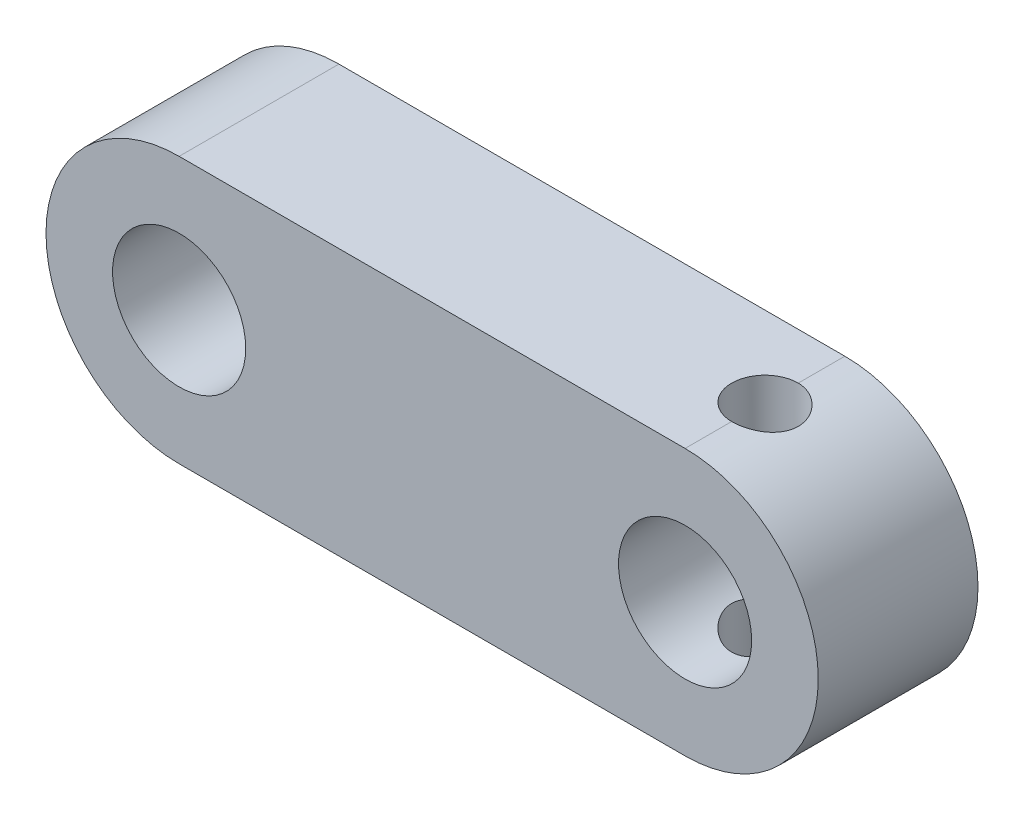
ISO-10303-21;
HEADER;
FILE_DESCRIPTION(('STEP AP214'),'2;1');
FILE_NAME('part.step','',(''),(''),'','','');
FILE_SCHEMA(('AUTOMOTIVE_DESIGN { 1 0 10303 214 1 1 1 1 }'));
ENDSEC;
DATA;
#1=APPLICATION_CONTEXT('core data for automotive mechanical design processes');
#2=APPLICATION_PROTOCOL_DEFINITION('international standard','automotive_design',2000,#1);
#3=PRODUCT_CONTEXT('',#1,'mechanical');
#4=PRODUCT('Part','Part','',(#3));
#5=PRODUCT_RELATED_PRODUCT_CATEGORY('part','',(#4));
#6=PRODUCT_DEFINITION_FORMATION('','',#4);
#7=PRODUCT_DEFINITION_CONTEXT('part definition',#1,'design');
#8=PRODUCT_DEFINITION('design','',#6,#7);
#9=PRODUCT_DEFINITION_SHAPE('','',#8);
#10=(LENGTH_UNIT() NAMED_UNIT(*) SI_UNIT(.MILLI.,.METRE.));
#11=(NAMED_UNIT(*) PLANE_ANGLE_UNIT() SI_UNIT($,.RADIAN.));
#12=(NAMED_UNIT(*) SI_UNIT($,.STERADIAN.) SOLID_ANGLE_UNIT());
#13=UNCERTAINTY_MEASURE_WITH_UNIT(LENGTH_MEASURE(1.E-05),#10,'distance_accuracy_value','');
#14=(GEOMETRIC_REPRESENTATION_CONTEXT(3) GLOBAL_UNCERTAINTY_ASSIGNED_CONTEXT((#13)) GLOBAL_UNIT_ASSIGNED_CONTEXT((#10,
#11,#12)) REPRESENTATION_CONTEXT('',''));
#15=CARTESIAN_POINT('',(0.,0.,0.));
#16=DIRECTION('',(0.,0.,1.));
#17=DIRECTION('',(1.,0.,0.));
#18=AXIS2_PLACEMENT_3D('',#15,#16,#17);
#19=CARTESIAN_POINT('',(0.,-5.,6.));
#20=DIRECTION('',(0.,1.,0.));
#21=DIRECTION('',(-1.,0.,0.));
#22=AXIS2_PLACEMENT_3D('',#19,#20,#21);
#23=PLANE('',#22);
#24=DIRECTION('',(0.,0.,-1.));
#25=VECTOR('',#24,1.);
#26=CARTESIAN_POINT('',(0.,-5.,6.));
#27=LINE('',#26,#25);
#28=CARTESIAN_POINT('',(0.,-5.,1.75));
#29=VERTEX_POINT('',#28);
#30=CARTESIAN_POINT('',(0.,-5.,0.));
#31=VERTEX_POINT('',#30);
#32=EDGE_CURVE('E59',#29,#31,#27,.T.);
#33=ORIENTED_EDGE('',*,*,#32,.F.);
#34=CARTESIAN_POINT('',(0.,-5.,3.));
#35=DIRECTION('',(0.,1.,0.));
#36=DIRECTION('',(-1.,0.,0.));
#37=AXIS2_PLACEMENT_3D('',#34,#35,#36);
#38=CIRCLE('',#37,1.25);
#39=CARTESIAN_POINT('',(0.,-5.,4.25));
#40=VERTEX_POINT('',#39);
#41=EDGE_CURVE('E66',#29,#40,#38,.T.);
#42=ORIENTED_EDGE('',*,*,#41,.T.);
#43=CARTESIAN_POINT('',(0.,-5.,6.));
#44=VERTEX_POINT('',#43);
#45=EDGE_CURVE('E11',#44,#40,#27,.T.);
#46=ORIENTED_EDGE('',*,*,#45,.F.);
#47=DIRECTION('',(1.,0.,0.));
#48=VECTOR('',#47,1.);
#49=CARTESIAN_POINT('',(0.,-5.,6.));
#50=LINE('',#49,#48);
#51=CARTESIAN_POINT('',(-19.,-5.,6.));
#52=VERTEX_POINT('',#51);
#53=EDGE_CURVE('E128',#52,#44,#50,.T.);
#54=ORIENTED_EDGE('',*,*,#53,.F.);
#55=DIRECTION('',(0.,0.,-1.));
#56=VECTOR('',#55,1.);
#57=CARTESIAN_POINT('',(-19.,-5.,6.));
#58=LINE('',#57,#56);
#59=CARTESIAN_POINT('',(-19.,-5.,0.));
#60=VERTEX_POINT('',#59);
#61=EDGE_CURVE('E161',#52,#60,#58,.T.);
#62=ORIENTED_EDGE('',*,*,#61,.T.);
#63=DIRECTION('',(1.,0.,0.));
#64=VECTOR('',#63,1.);
#65=CARTESIAN_POINT('',(0.,-5.,0.));
#66=LINE('',#65,#64);
#67=EDGE_CURVE('E107',#60,#31,#66,.T.);
#68=ORIENTED_EDGE('',*,*,#67,.T.);
#69=EDGE_LOOP('',(#33,#42,#46,#54,#62,#68));
#70=FACE_BOUND('',#69,.T.);
#71=ADVANCED_FACE('F45',(#70),#23,.F.);
#72=CARTESIAN_POINT('',(0.,0.,6.));
#73=DIRECTION('',(0.,0.,-1.));
#74=DIRECTION('',(-1.,0.,0.));
#75=AXIS2_PLACEMENT_3D('',#72,#73,#74);
#76=CYLINDRICAL_SURFACE('',#75,5.);
#77=ORIENTED_EDGE('',*,*,#45,.T.);
#78=CARTESIAN_POINT('',(0.,-5.,4.25));
#79=CARTESIAN_POINT('',(0.0345958562302209,-5.0000019722579,4.25000037596728));
#80=CARTESIAN_POINT('',(0.0691746356614408,-4.99964049853327,4.24856283362232));
#81=CARTESIAN_POINT('',(0.138074690009065,-4.99821165670057,4.24283189960491));
#82=CARTESIAN_POINT('',(0.172396004134671,-4.99714439837747,4.23853895209085));
#83=CARTESIAN_POINT('',(0.274465139321112,-4.99292311200059,4.22143810912928));
#84=CARTESIAN_POINT('',(0.341513249243137,-4.98874933969322,4.20440795127064));
#85=CARTESIAN_POINT('',(0.471688999751382,-4.97813091950626,4.15963564004484));
#86=CARTESIAN_POINT('',(0.534816787719993,-4.97168635705668,4.13189388965757));
#87=CARTESIAN_POINT('',(0.655545572093235,-4.95721274975939,4.06652314364557));
#88=CARTESIAN_POINT('',(0.71314528123347,-4.9491833371887,4.02889185273901));
#89=CARTESIAN_POINT('',(0.822333748844299,-4.93222877596496,3.94400088744877));
#90=CARTESIAN_POINT('',(0.873792811810744,-4.92328989428,3.89657720409775));
#91=CARTESIAN_POINT('',(0.968120686343936,-4.90561414775425,3.79379395796541));
#92=CARTESIAN_POINT('',(1.01098788995103,-4.89687732099803,3.73843291303243));
#93=CARTESIAN_POINT('',(1.08752317675397,-4.88045625179407,3.62033577282372));
#94=CARTESIAN_POINT('',(1.12104525768935,-4.87278955964096,3.55750239807233));
#95=CARTESIAN_POINT('',(1.17699856517473,-4.85957883642674,3.42687282973704));
#96=CARTESIAN_POINT('',(1.19943213398498,-4.85403435714,3.35907768771897));
#97=CARTESIAN_POINT('',(1.23212885111741,-4.84583735219479,3.22188118870495));
#98=CARTESIAN_POINT('',(1.24262665465126,-4.84312915309136,3.15253915845085));
#99=CARTESIAN_POINT('',(1.25188483835239,-4.84074468104983,3.0130277818398));
#100=CARTESIAN_POINT('',(1.25064686323158,-4.84106798326159,2.94285855278733));
#101=CARTESIAN_POINT('',(1.23665540776577,-4.8446600537067,2.80548652119275));
#102=CARTESIAN_POINT('',(1.22418184235989,-4.84785722065672,2.73825304428463));
#103=CARTESIAN_POINT('',(1.18851994298185,-4.85672263131267,2.6068652143792));
#104=CARTESIAN_POINT('',(1.16533094165133,-4.86239102892584,2.54271105343673));
#105=CARTESIAN_POINT('',(1.10865758109375,-4.87562602763813,2.41855092105437));
#106=CARTESIAN_POINT('',(1.07507149815993,-4.88321124161778,2.35859344948369));
#107=CARTESIAN_POINT('',(0.998629152870575,-4.89941445969409,2.24506647360989));
#108=CARTESIAN_POINT('',(0.955771485879237,-4.9080326201928,2.19149793913414));
#109=CARTESIAN_POINT('',(0.860558578337779,-4.9256313291404,2.09066946045423));
#110=CARTESIAN_POINT('',(0.807968103158214,-4.934615217068,2.04363198022335));
#111=CARTESIAN_POINT('',(0.695522582665563,-4.95171452428336,1.95899080021958));
#112=CARTESIAN_POINT('',(0.635665674524647,-4.95982971986492,1.92138952712924));
#113=CARTESIAN_POINT('',(0.510059841233778,-4.97431911628217,1.85660391585496));
#114=CARTESIAN_POINT('',(0.444288505949123,-4.98068629005484,1.82946145081492));
#115=CARTESIAN_POINT('',(0.308960596166964,-4.9909041477363,1.78671476563129));
#116=CARTESIAN_POINT('',(0.239409727026567,-4.99475851645472,1.77109364600094));
#117=CARTESIAN_POINT('',(0.141048479948131,-4.99808972265327,1.75765946217707));
#118=CARTESIAN_POINT('',(0.112896362009207,-4.99880512587133,1.75478660897153));
#119=CARTESIAN_POINT('',(0.0565006133131124,-4.9997600048023,1.7509590589455));
#120=CARTESIAN_POINT('',(0.028257209871407,-5.00000026301356,1.75000120835114));
#121=CARTESIAN_POINT('',(0.,-5.,1.74999999999999));
#122=B_SPLINE_CURVE_WITH_KNOTS('',3,(#78,#79,#80,#81,#82,#83,#84,#85,#86,#87,#88,#89,#90,#91,
#92,#93,#94,#95,#96,#97,#98,#99,#100,#101,#102,#103,#104,#105,#106,#107,#108,#109,#110,#111,
#112,#113,#114,#115,#116,#117,#118,#119,#120,#121),.UNSPECIFIED.,.F.,.F.,(4,2,2,2,2,2,2,2,2,2,2,
2,2,2,2,2,2,2,2,2,2,4),(0.,0.103722196092524,0.20742826196518,0.414262729871484,
0.621089417234318,0.827964149845958,1.03863501957543,1.24934527945168,1.46318342246191,
1.67697637646465,1.88648929459231,2.09597285094458,2.30037759052328,2.50479506216467,
2.7112793574333,2.91779495680266,3.1301776699636,3.34261494514174,3.55589411497133,
3.76885982177052,3.85372663354223,3.93845356459796),.UNSPECIFIED.);
#123=EDGE_CURVE('E102',#40,#29,#122,.T.);
#124=ORIENTED_EDGE('',*,*,#123,.T.);
#125=ORIENTED_EDGE('',*,*,#32,.T.);
#126=CARTESIAN_POINT('',(0.,0.,0.));
#127=DIRECTION('',(0.,0.,1.));
#128=DIRECTION('',(1.,0.,0.));
#129=AXIS2_PLACEMENT_3D('',#126,#127,#128);
#130=CIRCLE('',#129,5.);
#131=CARTESIAN_POINT('',(0.,5.,0.));
#132=VERTEX_POINT('',#131);
#133=EDGE_CURVE('E164',#31,#132,#130,.T.);
#134=ORIENTED_EDGE('',*,*,#133,.T.);
#135=DIRECTION('',(0.,0.,-1.));
#136=VECTOR('',#135,1.);
#137=CARTESIAN_POINT('',(0.,5.,6.));
#138=LINE('',#137,#136);
#139=CARTESIAN_POINT('',(0.,5.,1.75));
#140=VERTEX_POINT('',#139);
#141=EDGE_CURVE('E183',#140,#132,#138,.T.);
#142=ORIENTED_EDGE('',*,*,#141,.F.);
#143=CARTESIAN_POINT('',(0.,5.,1.75));
#144=CARTESIAN_POINT('',(0.0345958562302198,5.0000019722579,1.74999962403272));
#145=CARTESIAN_POINT('',(0.0691746356614397,4.99964049853327,1.75143716637768));
#146=CARTESIAN_POINT('',(0.138074690009063,4.99821165670057,1.75716810039509));
#147=CARTESIAN_POINT('',(0.17239600413467,4.99714439837747,1.76146104790916));
#148=CARTESIAN_POINT('',(0.274465139321111,4.99292311200059,1.77856189087072));
#149=CARTESIAN_POINT('',(0.341513249243136,4.98874933969321,1.79559204872936));
#150=CARTESIAN_POINT('',(0.471688999751381,4.97813091950626,1.84036435995516));
#151=CARTESIAN_POINT('',(0.534816787719992,4.97168635705668,1.86810611034243));
#152=CARTESIAN_POINT('',(0.655545572093234,4.95721274975939,1.93347685635443));
#153=CARTESIAN_POINT('',(0.713145281233469,4.9491833371887,1.97110814726099));
#154=CARTESIAN_POINT('',(0.822333748844298,4.93222877596496,2.05599911255123));
#155=CARTESIAN_POINT('',(0.873792811810742,4.92328989428,2.10342279590225));
#156=CARTESIAN_POINT('',(0.968120686343934,4.90561414775425,2.20620604203459));
#157=CARTESIAN_POINT('',(1.01098788995103,4.89687732099803,2.26156708696757));
#158=CARTESIAN_POINT('',(1.08752317675397,4.88045625179407,2.37966422717628));
#159=CARTESIAN_POINT('',(1.12104525768934,4.87278955964096,2.44249760192767));
#160=CARTESIAN_POINT('',(1.17699856517472,4.85957883642674,2.57312717026296));
#161=CARTESIAN_POINT('',(1.19943213398498,4.85403435714,2.64092231228103));
#162=CARTESIAN_POINT('',(1.23212885111741,4.84583735219479,2.77811881129505));
#163=CARTESIAN_POINT('',(1.24262665465126,4.84312915309136,2.84746084154916));
#164=CARTESIAN_POINT('',(1.25188483835239,4.84074468104983,2.9869722181602));
#165=CARTESIAN_POINT('',(1.25064686323158,4.84106798326159,3.05714144721267));
#166=CARTESIAN_POINT('',(1.23665540776577,4.8446600537067,3.19451347880725));
#167=CARTESIAN_POINT('',(1.22418184235989,4.84785722065672,3.26174695571537));
#168=CARTESIAN_POINT('',(1.18851994298185,4.85672263131267,3.3931347856208));
#169=CARTESIAN_POINT('',(1.16533094165133,4.86239102892585,3.45728894656327));
#170=CARTESIAN_POINT('',(1.10865758109375,4.87562602763813,3.58144907894563));
#171=CARTESIAN_POINT('',(1.07507149815992,4.88321124161778,3.64140655051632));
#172=CARTESIAN_POINT('',(0.998629152870572,4.89941445969409,3.75493352639011));
#173=CARTESIAN_POINT('',(0.955771485879234,4.9080326201928,3.80850206086586));
#174=CARTESIAN_POINT('',(0.860558578337777,4.9256313291404,3.90933053954577));
#175=CARTESIAN_POINT('',(0.807968103158212,4.934615217068,3.95636801977665));
#176=CARTESIAN_POINT('',(0.695522582665561,4.95171452428336,4.04100919978042));
#177=CARTESIAN_POINT('',(0.635665674524645,4.95982971986492,4.07861047287076));
#178=CARTESIAN_POINT('',(0.510059841233776,4.97431911628217,4.14339608414504));
#179=CARTESIAN_POINT('',(0.444288505949121,4.98068629005484,4.17053854918508));
#180=CARTESIAN_POINT('',(0.308960596166962,4.9909041477363,4.21328523436871));
#181=CARTESIAN_POINT('',(0.239409727026564,4.99475851645472,4.22890635399906));
#182=CARTESIAN_POINT('',(0.141048479948129,4.99808972265327,4.24234053782293));
#183=CARTESIAN_POINT('',(0.112896362009205,4.99880512587133,4.24521339102847));
#184=CARTESIAN_POINT('',(0.0565006133131106,4.9997600048023,4.2490409410545));
#185=CARTESIAN_POINT('',(0.0282572098714055,5.00000026301356,4.24999879164886));
#186=CARTESIAN_POINT('',(0.,5.,4.25000000000001));
#187=B_SPLINE_CURVE_WITH_KNOTS('',3,(#143,#144,#145,#146,#147,#148,#149,#150,#151,#152,#153,
#154,#155,#156,#157,#158,#159,#160,#161,#162,#163,#164,#165,#166,#167,#168,#169,#170,#171,#172,
#173,#174,#175,#176,#177,#178,#179,#180,#181,#182,#183,#184,#185,#186),.UNSPECIFIED.,.F.,.F.,(4,
2,2,2,2,2,2,2,2,2,2,2,2,2,2,2,2,2,2,2,2,4),(0.,0.103722196092524,0.20742826196518,
0.414262729871484,0.621089417234318,0.827964149845958,1.03863501957543,1.24934527945168,
1.46318342246191,1.67697637646465,1.88648929459231,2.09597285094458,2.30037759052328,
2.50479506216467,2.7112793574333,2.91779495680266,3.1301776699636,3.34261494514174,
3.55589411497132,3.76885982177052,3.85372663354223,3.93845356459796),.UNSPECIFIED.);
#188=CARTESIAN_POINT('',(0.,5.,4.25));
#189=VERTEX_POINT('',#188);
#190=EDGE_CURVE('E73',#140,#189,#187,.T.);
#191=ORIENTED_EDGE('',*,*,#190,.T.);
#192=CARTESIAN_POINT('',(0.,5.,6.));
#193=VERTEX_POINT('',#192);
#194=EDGE_CURVE('E122',#193,#189,#138,.T.);
#195=ORIENTED_EDGE('',*,*,#194,.F.);
#196=CARTESIAN_POINT('',(0.,0.,6.));
#197=DIRECTION('',(0.,0.,1.));
#198=DIRECTION('',(1.,0.,0.));
#199=AXIS2_PLACEMENT_3D('',#196,#197,#198);
#200=CIRCLE('',#199,5.);
#201=EDGE_CURVE('E119',#44,#193,#200,.T.);
#202=ORIENTED_EDGE('',*,*,#201,.F.);
#203=EDGE_LOOP('',(#77,#124,#125,#134,#142,#191,#195,#202));
#204=FACE_BOUND('',#203,.T.);
#205=ADVANCED_FACE('F117',(#204),#76,.T.);
#206=CARTESIAN_POINT('',(0.,5.,6.));
#207=DIRECTION('',(0.,1.,0.));
#208=DIRECTION('',(-1.,0.,0.));
#209=AXIS2_PLACEMENT_3D('',#206,#207,#208);
#210=PLANE('',#209);
#211=CARTESIAN_POINT('',(0.,5.,3.));
#212=DIRECTION('',(0.,1.,0.));
#213=DIRECTION('',(-1.,0.,0.));
#214=AXIS2_PLACEMENT_3D('',#211,#212,#213);
#215=CIRCLE('',#214,1.25);
#216=EDGE_CURVE('E115',#140,#189,#215,.T.);
#217=ORIENTED_EDGE('',*,*,#216,.F.);
#218=ORIENTED_EDGE('',*,*,#141,.T.);
#219=DIRECTION('',(1.,0.,0.));
#220=VECTOR('',#219,1.);
#221=CARTESIAN_POINT('',(0.,5.,0.));
#222=LINE('',#221,#220);
#223=CARTESIAN_POINT('',(-19.,5.,0.));
#224=VERTEX_POINT('',#223);
#225=EDGE_CURVE('E168',#224,#132,#222,.T.);
#226=ORIENTED_EDGE('',*,*,#225,.F.);
#227=DIRECTION('',(0.,0.,-1.));
#228=VECTOR('',#227,1.);
#229=CARTESIAN_POINT('',(-19.,5.,6.));
#230=LINE('',#229,#228);
#231=CARTESIAN_POINT('',(-19.,5.,6.));
#232=VERTEX_POINT('',#231);
#233=EDGE_CURVE('E180',#232,#224,#230,.T.);
#234=ORIENTED_EDGE('',*,*,#233,.F.);
#235=DIRECTION('',(1.,0.,0.));
#236=VECTOR('',#235,1.);
#237=CARTESIAN_POINT('',(0.,5.,6.));
#238=LINE('',#237,#236);
#239=EDGE_CURVE('E127',#232,#193,#238,.T.);
#240=ORIENTED_EDGE('',*,*,#239,.T.);
#241=ORIENTED_EDGE('',*,*,#194,.T.);
#242=EDGE_LOOP('',(#217,#218,#226,#234,#240,#241));
#243=FACE_BOUND('',#242,.T.);
#244=ADVANCED_FACE('F211',(#243),#210,.T.);
#245=CARTESIAN_POINT('',(-19.,0.,6.));
#246=DIRECTION('',(0.,0.,-1.));
#247=DIRECTION('',(-1.,0.,0.));
#248=AXIS2_PLACEMENT_3D('',#245,#246,#247);
#249=CYLINDRICAL_SURFACE('',#248,2.5);
#250=CARTESIAN_POINT('',(-19.,0.,6.));
#251=DIRECTION('',(0.,0.,1.));
#252=DIRECTION('',(1.,0.,0.));
#253=AXIS2_PLACEMENT_3D('',#250,#251,#252);
#254=CIRCLE('',#253,2.5);
#255=CARTESIAN_POINT('',(-16.5,0.,6.));
#256=VERTEX_POINT('',#255);
#257=EDGE_CURVE('E153',#256,#256,#254,.T.);
#258=ORIENTED_EDGE('',*,*,#257,.T.);
#259=EDGE_LOOP('',(#258));
#260=FACE_BOUND('',#259,.T.);
#261=CARTESIAN_POINT('',(-19.,0.,0.));
#262=DIRECTION('',(0.,0.,1.));
#263=DIRECTION('',(1.,0.,0.));
#264=AXIS2_PLACEMENT_3D('',#261,#262,#263);
#265=CIRCLE('',#264,2.5);
#266=CARTESIAN_POINT('',(-16.5,0.,0.));
#267=VERTEX_POINT('',#266);
#268=EDGE_CURVE('E141',#267,#267,#265,.T.);
#269=ORIENTED_EDGE('',*,*,#268,.F.);
#270=EDGE_LOOP('',(#269));
#271=FACE_BOUND('',#270,.T.);
#272=ADVANCED_FACE('F215',(#260,#271),#249,.F.);
#273=CARTESIAN_POINT('',(-19.,0.,6.));
#274=DIRECTION('',(0.,0.,-1.));
#275=DIRECTION('',(-1.,0.,0.));
#276=AXIS2_PLACEMENT_3D('',#273,#274,#275);
#277=CYLINDRICAL_SURFACE('',#276,5.);
#278=CARTESIAN_POINT('',(-19.,0.,0.));
#279=DIRECTION('',(0.,0.,1.));
#280=DIRECTION('',(1.,0.,0.));
#281=AXIS2_PLACEMENT_3D('',#278,#279,#280);
#282=CIRCLE('',#281,5.);
#283=EDGE_CURVE('E172',#224,#60,#282,.T.);
#284=ORIENTED_EDGE('',*,*,#283,.T.);
#285=ORIENTED_EDGE('',*,*,#61,.F.);
#286=CARTESIAN_POINT('',(-19.,0.,6.));
#287=DIRECTION('',(0.,0.,1.));
#288=DIRECTION('',(1.,0.,0.));
#289=AXIS2_PLACEMENT_3D('',#286,#287,#288);
#290=CIRCLE('',#289,5.);
#291=EDGE_CURVE('E133',#232,#52,#290,.T.);
#292=ORIENTED_EDGE('',*,*,#291,.F.);
#293=ORIENTED_EDGE('',*,*,#233,.T.);
#294=EDGE_LOOP('',(#284,#285,#292,#293));
#295=FACE_BOUND('',#294,.T.);
#296=ADVANCED_FACE('F217',(#295),#277,.T.);
#297=CARTESIAN_POINT('',(0.,0.,6.));
#298=DIRECTION('',(0.,0.,-1.));
#299=DIRECTION('',(-1.,0.,0.));
#300=AXIS2_PLACEMENT_3D('',#297,#298,#299);
#301=CYLINDRICAL_SURFACE('',#300,2.5);
#302=CARTESIAN_POINT('',(-1.25,-2.1650635094611,3.));
#303=CARTESIAN_POINT('',(-1.24999545384316,-2.16506918410574,3.06513476024406));
#304=CARTESIAN_POINT('',(-1.24487496341652,-2.16804751484696,3.13035176440631));
#305=CARTESIAN_POINT('',(-1.22465401237257,-2.17952958065066,3.25878408084644));
#306=CARTESIAN_POINT('',(-1.20953258069272,-2.18804492569449,3.32199489380426));
#307=CARTESIAN_POINT('',(-1.17012493587476,-2.20936683256748,3.44431458042993));
#308=CARTESIAN_POINT('',(-1.14588744061716,-2.22215054341565,3.50344331559198));
#309=CARTESIAN_POINT('',(-1.08908440672046,-2.25053331021072,3.6167802524959));
#310=CARTESIAN_POINT('',(-1.05651841754472,-2.26613251845081,3.67098818782807));
#311=CARTESIAN_POINT('',(-0.980833175663597,-2.29996086321802,3.77788216069688));
#312=CARTESIAN_POINT('',(-0.937065045179712,-2.31830079547442,3.83007391959193));
#313=CARTESIAN_POINT('',(-0.841567259518084,-2.35464978482132,3.92676048550839));
#314=CARTESIAN_POINT('',(-0.789833657227865,-2.37265867289062,3.9712514532294));
#315=CARTESIAN_POINT('',(-0.675611954268181,-2.40776846191186,4.05420893893458));
#316=CARTESIAN_POINT('',(-0.612633986265717,-2.42472633022716,4.09206720982441));
#317=CARTESIAN_POINT('',(-0.480196283249378,-2.45438445124411,4.1564260665572));
#318=CARTESIAN_POINT('',(-0.410740672672692,-2.46708738979677,4.18293382017146));
#319=CARTESIAN_POINT('',(-0.272556179907469,-2.48600576555297,4.22188082662637));
#320=CARTESIAN_POINT('',(-0.20412723811102,-2.49261850276115,4.23518690794442));
#321=CARTESIAN_POINT('',(-0.0657132858723086,-2.50009479807584,4.2502076483438));
#322=CARTESIAN_POINT('',(0.00427075730467444,-2.50096183480737,4.25192932099464));
#323=CARTESIAN_POINT('',(0.137290655529688,-2.49703727395563,4.24406665753706));
#324=CARTESIAN_POINT('',(0.20040149897099,-2.492731198652,4.23545248059847));
#325=CARTESIAN_POINT('',(0.324142214897903,-2.47967806574684,4.20889894511918));
#326=CARTESIAN_POINT('',(0.384771901367408,-2.47093067582992,4.19095888877972));
#327=CARTESIAN_POINT('',(0.502886739461943,-2.44964479109568,4.14614679238773));
#328=CARTESIAN_POINT('',(0.560316779393974,-2.43705551911499,4.11915460853492));
#329=CARTESIAN_POINT('',(0.669971001891661,-2.40922057483359,4.05717072974813));
#330=CARTESIAN_POINT('',(0.722193311048308,-2.39397395196855,4.02217617087206));
#331=CARTESIAN_POINT('',(0.825217076122745,-2.36055492999036,3.94138081058373));
#332=CARTESIAN_POINT('',(0.875417593786702,-2.34224219997719,3.89487121459249));
#333=CARTESIAN_POINT('',(0.967630462872226,-2.30567925733514,3.79426284383728));
#334=CARTESIAN_POINT('',(1.00963651446779,-2.28742910332036,3.74015828465742));
#335=CARTESIAN_POINT('',(1.08688166830277,-2.25180195115606,3.62168975946989));
#336=CARTESIAN_POINT('',(1.12152164372257,-2.23455399988384,3.55689247118224));
#337=CARTESIAN_POINT('',(1.17914889125154,-2.2046931284822,3.42132791080125));
#338=CARTESIAN_POINT('',(1.20214832276361,-2.19207537557584,3.35056695872805));
#339=CARTESIAN_POINT('',(1.2339752637813,-2.17430794771293,3.21098186089651));
#340=CARTESIAN_POINT('',(1.24378140264997,-2.1686456981062,3.14244860119556));
#341=CARTESIAN_POINT('',(1.25189618326428,-2.16397399202012,3.00449832310432));
#342=CARTESIAN_POINT('',(1.25021294664378,-2.16495983611639,2.93508196360027));
#343=CARTESIAN_POINT('',(1.23629505417996,-2.17292920675731,2.80543260177659));
#344=CARTESIAN_POINT('',(1.22523477089059,-2.17924484383318,2.74502568611509));
#345=CARTESIAN_POINT('',(1.19462035579055,-2.19617526939176,2.6270402671613));
#346=CARTESIAN_POINT('',(1.17506347327952,-2.20679145006292,2.56946268656674));
#347=CARTESIAN_POINT('',(1.12705948575611,-2.23170277599571,2.45573583637163));
#348=CARTESIAN_POINT('',(1.09824257961591,-2.24614554053829,2.39977622893306));
#349=CARTESIAN_POINT('',(1.03285883001976,-2.27695149371562,2.29316341057626));
#350=CARTESIAN_POINT('',(0.996288005415272,-2.29331566693934,2.2425129456084));
#351=CARTESIAN_POINT('',(0.911046458998569,-2.3285999807042,2.14127654059557));
#352=CARTESIAN_POINT('',(0.86143159039371,-2.34758228942861,2.09150356160293));
#353=CARTESIAN_POINT('',(0.754255619247863,-2.38417793722366,2.00073470250801));
#354=CARTESIAN_POINT('',(0.696691843319186,-2.40179081259636,1.95974178721183));
#355=CARTESIAN_POINT('',(0.573169203198449,-2.43426702113696,1.88678284256237));
#356=CARTESIAN_POINT('',(0.507028871967644,-2.44904552090036,1.85508360223636));
#357=CARTESIAN_POINT('',(0.369402955801355,-2.47354193699126,1.80357762017826));
#358=CARTESIAN_POINT('',(0.297922126740222,-2.48326429595466,1.78376043579212));
#359=CARTESIAN_POINT('',(0.158724602913023,-2.49584385227353,1.75828929478167));
#360=CARTESIAN_POINT('',(0.0912643048130733,-2.49924909885239,1.75150265515486));
#361=CARTESIAN_POINT('',(-0.0439074824390025,-2.50052662968914,1.748945918182));
#362=CARTESIAN_POINT('',(-0.111618875368857,-2.49840085083612,1.75317196434555));
#363=CARTESIAN_POINT('',(-0.240672490396432,-2.48917461047403,1.77177050849453));
#364=CARTESIAN_POINT('',(-0.302140397264078,-2.48241118334987,1.78545606157209));
#365=CARTESIAN_POINT('',(-0.42180744022952,-2.46490117079279,1.82165874912871));
#366=CARTESIAN_POINT('',(-0.480006106194384,-2.45415401415995,1.84417715011682));
#367=CARTESIAN_POINT('',(-0.594279257806104,-2.4290741343515,1.89840881520747));
#368=CARTESIAN_POINT('',(-0.650156428375056,-2.41460771498499,1.9304741540098));
#369=CARTESIAN_POINT('',(-0.755968302267529,-2.38360166427283,2.00244741357381));
#370=CARTESIAN_POINT('',(-0.805900259268632,-2.36706108197951,2.04235893639459));
#371=CARTESIAN_POINT('',(-0.903642505196112,-2.33160762783285,2.13349642377838));
#372=CARTESIAN_POINT('',(-0.950747105674088,-2.31262248764622,2.18545310934649));
#373=CARTESIAN_POINT('',(-1.03582910924334,-2.27578845203566,2.29681340141221));
#374=CARTESIAN_POINT('',(-1.07379843751257,-2.25794057202332,2.3562235260846));
#375=CARTESIAN_POINT('',(-1.14053884973207,-2.22499506631145,2.48329580822619));
#376=CARTESIAN_POINT('',(-1.16898133245117,-2.21000217820338,2.55115941391092));
#377=CARTESIAN_POINT('',(-1.21359838688301,-2.1858269541044,2.69166550542472));
#378=CARTESIAN_POINT('',(-1.22981398896918,-2.17662520184627,2.76429111114086));
#379=CARTESIAN_POINT('',(-1.24295875983052,-2.16911590752238,2.86475669456499));
#380=CARTESIAN_POINT('',(-1.24559513120481,-2.1676016125644,2.89170986799735));
#381=CARTESIAN_POINT('',(-1.24911675636245,-2.16557419859688,2.9457706008528));
#382=CARTESIAN_POINT('',(-1.25000189299984,-2.16506114656387,2.97287817048234));
#383=CARTESIAN_POINT('',(-1.25,-2.1650635094611,3.));
#384=B_SPLINE_CURVE_WITH_KNOTS('',3,(#302,#303,#304,#305,#306,#307,#308,#309,#310,#311,#312,
#313,#314,#315,#316,#317,#318,#319,#320,#321,#322,#323,#324,#325,#326,#327,#328,#329,#330,#331,
#332,#333,#334,#335,#336,#337,#338,#339,#340,#341,#342,#343,#344,#345,#346,#347,#348,#349,#350,
#351,#352,#353,#354,#355,#356,#357,#358,#359,#360,#361,#362,#363,#364,#365,#366,#367,#368,#369,
#370,#371,#372,#373,#374,#375,#376,#377,#378,#379,#380,#381,#382,#383),.UNSPECIFIED.,.T.,.F.,(4,
2,2,2,2,2,2,2,2,2,2,2,2,2,2,2,2,2,2,2,2,2,2,2,2,2,2,2,2,2,2,2,2,2,2,2,2,2,2,2,4),(0.,
0.195290153243395,0.390991116031006,0.585660744898608,0.780340906806437,0.991077890622792,
1.20191963855464,1.42697365298454,1.65188533704864,1.86079356209919,2.0695752960755,
2.26020121855673,2.45084140646819,2.64411918413933,2.8374662418784,3.04908989321113,
3.26087560307398,3.48611052161811,3.71110967764631,3.91827863567765,4.12530116485466,
4.30967729280032,4.49411315545079,4.6870912050761,4.88016857775059,5.09758429475767,
5.31507331222753,5.53830226766207,5.76133474760965,5.96390337986859,6.16640108492465,
6.35555531089366,6.54473666890016,6.7420093839934,6.93937287625899,7.15637802312584,
7.37357428556443,7.59763436298256,7.8209391625345,7.90225168981637,7.98356965618176),.UNSPECIFIED.);
#385=CARTESIAN_POINT('',(-1.25,-2.1650635094611,3.));
#386=VERTEX_POINT('',#385);
#387=EDGE_CURVE('E48',#386,#386,#384,.T.);
#388=ORIENTED_EDGE('',*,*,#387,.F.);
#389=EDGE_LOOP('',(#388));
#390=FACE_BOUND('',#389,.T.);
#391=CARTESIAN_POINT('',(-1.25,2.1650635094611,3.));
#392=CARTESIAN_POINT('',(-1.24999545384316,2.16506918410574,2.93486523975594));
#393=CARTESIAN_POINT('',(-1.24487496341652,2.16804751484696,2.86964823559369));
#394=CARTESIAN_POINT('',(-1.22465401237257,2.17952958065066,2.74121591915356));
#395=CARTESIAN_POINT('',(-1.20953258069272,2.18804492569449,2.67800510619574));
#396=CARTESIAN_POINT('',(-1.17012493587476,2.20936683256748,2.55568541957007));
#397=CARTESIAN_POINT('',(-1.14588744061716,2.22215054341565,2.49655668440802));
#398=CARTESIAN_POINT('',(-1.08908440672046,2.25053331021072,2.3832197475041));
#399=CARTESIAN_POINT('',(-1.05651841754472,2.26613251845081,2.32901181217193));
#400=CARTESIAN_POINT('',(-0.980833175663598,2.29996086321802,2.22211783930312));
#401=CARTESIAN_POINT('',(-0.937065045179713,2.31830079547442,2.16992608040807));
#402=CARTESIAN_POINT('',(-0.841567259518085,2.35464978482132,2.07323951449161));
#403=CARTESIAN_POINT('',(-0.789833657227866,2.37265867289062,2.0287485467706));
#404=CARTESIAN_POINT('',(-0.675611954268182,2.40776846191186,1.94579106106542));
#405=CARTESIAN_POINT('',(-0.612633986265718,2.42472633022716,1.90793279017559));
#406=CARTESIAN_POINT('',(-0.48019628324938,2.45438445124411,1.8435739334428));
#407=CARTESIAN_POINT('',(-0.410740672672694,2.46708738979677,1.81706617982854));
#408=CARTESIAN_POINT('',(-0.272556179907471,2.48600576555297,1.77811917337363));
#409=CARTESIAN_POINT('',(-0.204127238111022,2.49261850276115,1.76481309205558));
#410=CARTESIAN_POINT('',(-0.0657132858723101,2.50009479807584,1.7497923516562));
#411=CARTESIAN_POINT('',(0.00427075730467315,2.50096183480737,1.74807067900536));
#412=CARTESIAN_POINT('',(0.137290655529687,2.49703727395563,1.75593334246294));
#413=CARTESIAN_POINT('',(0.200401498970989,2.492731198652,1.76454751940153));
#414=CARTESIAN_POINT('',(0.324142214897902,2.47967806574684,1.79110105488082));
#415=CARTESIAN_POINT('',(0.384771901367407,2.47093067582992,1.80904111122028));
#416=CARTESIAN_POINT('',(0.502886739461942,2.44964479109568,1.85385320761227));
#417=CARTESIAN_POINT('',(0.560316779393973,2.43705551911499,1.88084539146508));
#418=CARTESIAN_POINT('',(0.669971001891661,2.40922057483359,1.94282927025187));
#419=CARTESIAN_POINT('',(0.722193311048307,2.39397395196855,1.97782382912794));
#420=CARTESIAN_POINT('',(0.825217076122744,2.36055492999036,2.05861918941627));
#421=CARTESIAN_POINT('',(0.875417593786701,2.34224219997719,2.10512878540751));
#422=CARTESIAN_POINT('',(0.967630462872226,2.30567925733515,2.20573715616272));
#423=CARTESIAN_POINT('',(1.00963651446779,2.28742910332036,2.25984171534258));
#424=CARTESIAN_POINT('',(1.08688166830276,2.25180195115606,2.37831024053011));
#425=CARTESIAN_POINT('',(1.12152164372256,2.23455399988384,2.44310752881776));
#426=CARTESIAN_POINT('',(1.17914889125154,2.2046931284822,2.57867208919875));
#427=CARTESIAN_POINT('',(1.20214832276361,2.19207537557584,2.64943304127195));
#428=CARTESIAN_POINT('',(1.2339752637813,2.17430794771293,2.78901813910349));
#429=CARTESIAN_POINT('',(1.24378140264997,2.1686456981062,2.85755139880444));
#430=CARTESIAN_POINT('',(1.25189618326428,2.16397399202012,2.99550167689568));
#431=CARTESIAN_POINT('',(1.25021294664378,2.16495983611639,3.06491803639973));
#432=CARTESIAN_POINT('',(1.23629505417996,2.17292920675731,3.19456739822341));
#433=CARTESIAN_POINT('',(1.22523477089058,2.17924484383318,3.25497431388491));
#434=CARTESIAN_POINT('',(1.19462035579055,2.19617526939176,3.3729597328387));
#435=CARTESIAN_POINT('',(1.17506347327952,2.20679145006292,3.43053731343326));
#436=CARTESIAN_POINT('',(1.12705948575611,2.23170277599571,3.54426416362837));
#437=CARTESIAN_POINT('',(1.09824257961591,2.24614554053829,3.60022377106694));
#438=CARTESIAN_POINT('',(1.03285883001976,2.27695149371562,3.70683658942374));
#439=CARTESIAN_POINT('',(0.996288005415271,2.29331566693934,3.7574870543916));
#440=CARTESIAN_POINT('',(0.911046458998568,2.3285999807042,3.85872345940444));
#441=CARTESIAN_POINT('',(0.861431590393709,2.34758228942861,3.90849643839707));
#442=CARTESIAN_POINT('',(0.754255619247861,2.38417793722366,3.99926529749199));
#443=CARTESIAN_POINT('',(0.696691843319184,2.40179081259637,4.04025821278818));
#444=CARTESIAN_POINT('',(0.573169203198447,2.43426702113696,4.11321715743763));
#445=CARTESIAN_POINT('',(0.507028871967642,2.44904552090036,4.14491639776364));
#446=CARTESIAN_POINT('',(0.369402955801354,2.47354193699126,4.19642237982174));
#447=CARTESIAN_POINT('',(0.297922126740221,2.48326429595466,4.21623956420788));
#448=CARTESIAN_POINT('',(0.158724602913022,2.49584385227353,4.24171070521833));
#449=CARTESIAN_POINT('',(0.0912643048130723,2.49924909885239,4.24849734484514));
#450=CARTESIAN_POINT('',(-0.0439074824390035,2.50052662968914,4.251054081818));
#451=CARTESIAN_POINT('',(-0.111618875368857,2.49840085083612,4.24682803565446));
#452=CARTESIAN_POINT('',(-0.240672490396433,2.48917461047403,4.22822949150547));
#453=CARTESIAN_POINT('',(-0.302140397264079,2.48241118334987,4.21454393842791));
#454=CARTESIAN_POINT('',(-0.421807440229522,2.46490117079279,4.17834125087129));
#455=CARTESIAN_POINT('',(-0.480006106194385,2.45415401415995,4.15582284988318));
#456=CARTESIAN_POINT('',(-0.594279257806105,2.4290741343515,4.10159118479253));
#457=CARTESIAN_POINT('',(-0.650156428375057,2.41460771498499,4.0695258459902));
#458=CARTESIAN_POINT('',(-0.75596830226753,2.38360166427283,3.99755258642619));
#459=CARTESIAN_POINT('',(-0.805900259268633,2.36706108197951,3.95764106360541));
#460=CARTESIAN_POINT('',(-0.903642505196113,2.33160762783285,3.86650357622162));
#461=CARTESIAN_POINT('',(-0.950747105674089,2.31262248764622,3.81454689065351));
#462=CARTESIAN_POINT('',(-1.03582910924334,2.27578845203565,3.70318659858779));
#463=CARTESIAN_POINT('',(-1.07379843751257,2.25794057202332,3.6437764739154));
#464=CARTESIAN_POINT('',(-1.14053884973207,2.22499506631145,3.51670419177381));
#465=CARTESIAN_POINT('',(-1.16898133245117,2.21000217820338,3.44884058608908));
#466=CARTESIAN_POINT('',(-1.21359838688301,2.18582695410439,3.30833449457528));
#467=CARTESIAN_POINT('',(-1.22981398896918,2.17662520184627,3.23570888885914));
#468=CARTESIAN_POINT('',(-1.24295875983052,2.16911590752238,3.13524330543501));
#469=CARTESIAN_POINT('',(-1.24559513120481,2.1676016125644,3.10829013200265));
#470=CARTESIAN_POINT('',(-1.24911675636245,2.16557419859688,3.0542293991472));
#471=CARTESIAN_POINT('',(-1.25000189299984,2.16506114656387,3.02712182951766));
#472=CARTESIAN_POINT('',(-1.25,2.1650635094611,3.));
#473=B_SPLINE_CURVE_WITH_KNOTS('',3,(#391,#392,#393,#394,#395,#396,#397,#398,#399,#400,#401,
#402,#403,#404,#405,#406,#407,#408,#409,#410,#411,#412,#413,#414,#415,#416,#417,#418,#419,#420,
#421,#422,#423,#424,#425,#426,#427,#428,#429,#430,#431,#432,#433,#434,#435,#436,#437,#438,#439,
#440,#441,#442,#443,#444,#445,#446,#447,#448,#449,#450,#451,#452,#453,#454,#455,#456,#457,#458,
#459,#460,#461,#462,#463,#464,#465,#466,#467,#468,#469,#470,#471,#472),.UNSPECIFIED.,.T.,.F.,(4,
2,2,2,2,2,2,2,2,2,2,2,2,2,2,2,2,2,2,2,2,2,2,2,2,2,2,2,2,2,2,2,2,2,2,2,2,2,2,2,4),(0.,
0.195290153243395,0.390991116031006,0.585660744898608,0.780340906806437,0.991077890622793,
1.20191963855464,1.42697365298454,1.65188533704864,1.86079356209919,2.0695752960755,
2.26020121855673,2.45084140646819,2.64411918413933,2.8374662418784,3.04908989321113,
3.26087560307398,3.4861105216181,3.71110967764631,3.91827863567765,4.12530116485466,
4.30967729280032,4.49411315545079,4.68709120507609,4.88016857775059,5.09758429475766,
5.31507331222753,5.53830226766207,5.76133474760964,5.96390337986858,6.16640108492464,
6.35555531089366,6.54473666890016,6.7420093839934,6.93937287625899,7.15637802312584,
7.37357428556443,7.59763436298256,7.8209391625345,7.90225168981636,7.98356965618176),.UNSPECIFIED.);
#474=CARTESIAN_POINT('',(-1.25,2.1650635094611,3.));
#475=VERTEX_POINT('',#474);
#476=EDGE_CURVE('E114',#475,#475,#473,.T.);
#477=ORIENTED_EDGE('',*,*,#476,.F.);
#478=EDGE_LOOP('',(#477));
#479=FACE_BOUND('',#478,.T.);
#480=CARTESIAN_POINT('',(0.,0.,6.));
#481=DIRECTION('',(0.,0.,1.));
#482=DIRECTION('',(1.,0.,0.));
#483=AXIS2_PLACEMENT_3D('',#480,#481,#482);
#484=CIRCLE('',#483,2.5);
#485=CARTESIAN_POINT('',(2.5,0.,6.));
#486=VERTEX_POINT('',#485);
#487=EDGE_CURVE('E157',#486,#486,#484,.T.);
#488=ORIENTED_EDGE('',*,*,#487,.T.);
#489=EDGE_LOOP('',(#488));
#490=FACE_BOUND('',#489,.T.);
#491=CARTESIAN_POINT('',(0.,0.,0.));
#492=DIRECTION('',(0.,0.,1.));
#493=DIRECTION('',(1.,0.,0.));
#494=AXIS2_PLACEMENT_3D('',#491,#492,#493);
#495=CIRCLE('',#494,2.5);
#496=CARTESIAN_POINT('',(2.5,0.,0.));
#497=VERTEX_POINT('',#496);
#498=EDGE_CURVE('E137',#497,#497,#495,.T.);
#499=ORIENTED_EDGE('',*,*,#498,.F.);
#500=EDGE_LOOP('',(#499));
#501=FACE_BOUND('',#500,.T.);
#502=ADVANCED_FACE('F190',(#390,#479,#490,#501),#301,.F.);
#503=CARTESIAN_POINT('',(0.,0.,6.));
#504=DIRECTION('',(0.,0.,1.));
#505=DIRECTION('',(1.,0.,0.));
#506=AXIS2_PLACEMENT_3D('',#503,#504,#505);
#507=PLANE('',#506);
#508=ORIENTED_EDGE('',*,*,#53,.T.);
#509=ORIENTED_EDGE('',*,*,#201,.T.);
#510=ORIENTED_EDGE('',*,*,#239,.F.);
#511=ORIENTED_EDGE('',*,*,#291,.T.);
#512=EDGE_LOOP('',(#508,#509,#510,#511));
#513=FACE_BOUND('',#512,.T.);
#514=ORIENTED_EDGE('',*,*,#257,.F.);
#515=EDGE_LOOP('',(#514));
#516=FACE_BOUND('',#515,.T.);
#517=ORIENTED_EDGE('',*,*,#487,.F.);
#518=EDGE_LOOP('',(#517));
#519=FACE_BOUND('',#518,.T.);
#520=ADVANCED_FACE('F130',(#513,#516,#519),#507,.T.);
#521=CARTESIAN_POINT('',(0.,0.,0.));
#522=DIRECTION('',(0.,0.,1.));
#523=DIRECTION('',(1.,0.,0.));
#524=AXIS2_PLACEMENT_3D('',#521,#522,#523);
#525=PLANE('',#524);
#526=ORIENTED_EDGE('',*,*,#67,.F.);
#527=ORIENTED_EDGE('',*,*,#283,.F.);
#528=ORIENTED_EDGE('',*,*,#225,.T.);
#529=ORIENTED_EDGE('',*,*,#133,.F.);
#530=EDGE_LOOP('',(#526,#527,#528,#529));
#531=FACE_BOUND('',#530,.T.);
#532=ORIENTED_EDGE('',*,*,#268,.T.);
#533=EDGE_LOOP('',(#532));
#534=FACE_BOUND('',#533,.T.);
#535=ORIENTED_EDGE('',*,*,#498,.T.);
#536=EDGE_LOOP('',(#535));
#537=FACE_BOUND('',#536,.T.);
#538=ADVANCED_FACE('F233',(#531,#534,#537),#525,.F.);
#539=CARTESIAN_POINT('',(0.,-5.,3.));
#540=DIRECTION('',(0.,1.,0.));
#541=DIRECTION('',(-1.,0.,0.));
#542=AXIS2_PLACEMENT_3D('',#539,#540,#541);
#543=CYLINDRICAL_SURFACE('',#542,1.25);
#544=ORIENTED_EDGE('',*,*,#476,.T.);
#545=EDGE_LOOP('',(#544));
#546=FACE_BOUND('',#545,.T.);
#547=ORIENTED_EDGE('',*,*,#216,.T.);
#548=ORIENTED_EDGE('',*,*,#190,.F.);
#549=EDGE_LOOP('',(#547,#548));
#550=FACE_BOUND('',#549,.T.);
#551=ADVANCED_FACE('F197',(#546,#550),#543,.F.);
#552=ORIENTED_EDGE('',*,*,#387,.T.);
#553=EDGE_LOOP('',(#552));
#554=FACE_BOUND('',#553,.T.);
#555=ORIENTED_EDGE('',*,*,#41,.F.);
#556=ORIENTED_EDGE('',*,*,#123,.F.);
#557=EDGE_LOOP('',(#555,#556));
#558=FACE_BOUND('',#557,.T.);
#559=ADVANCED_FACE('F103',(#554,#558),#543,.F.);
#560=CLOSED_SHELL('',(#71,#205,#244,#272,#296,#502,#520,#538,#551,#559));
#561=MANIFOLD_SOLID_BREP('B2',#560);
#562=ADVANCED_BREP_SHAPE_REPRESENTATION('',(#18,#561),#14);
#563=SHAPE_DEFINITION_REPRESENTATION(#9,#562);
ENDSEC;
END-ISO-10303-21;
